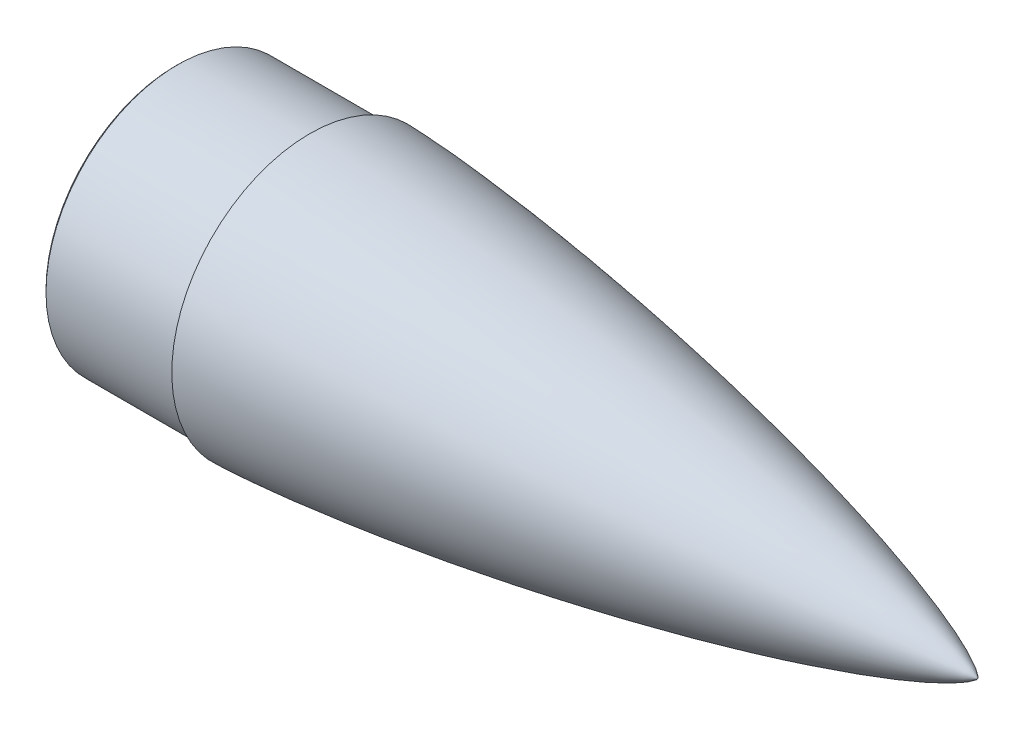
ISO-10303-21;
HEADER;
FILE_DESCRIPTION(('STEP AP214'),'2;1');
FILE_NAME('part.step','',(''),(''),'','','');
FILE_SCHEMA(('AUTOMOTIVE_DESIGN { 1 0 10303 214 1 1 1 1 }'));
ENDSEC;
DATA;
#1=APPLICATION_CONTEXT('core data for automotive mechanical design processes');
#2=APPLICATION_PROTOCOL_DEFINITION('international standard','automotive_design',2000,#1);
#3=PRODUCT_CONTEXT('',#1,'mechanical');
#4=PRODUCT('Part','Part','',(#3));
#5=PRODUCT_RELATED_PRODUCT_CATEGORY('part','',(#4));
#6=PRODUCT_DEFINITION_FORMATION('','',#4);
#7=PRODUCT_DEFINITION_CONTEXT('part definition',#1,'design');
#8=PRODUCT_DEFINITION('design','',#6,#7);
#9=PRODUCT_DEFINITION_SHAPE('','',#8);
#10=(LENGTH_UNIT() NAMED_UNIT(*) SI_UNIT(.MILLI.,.METRE.));
#11=(NAMED_UNIT(*) PLANE_ANGLE_UNIT() SI_UNIT($,.RADIAN.));
#12=(NAMED_UNIT(*) SI_UNIT($,.STERADIAN.) SOLID_ANGLE_UNIT());
#13=UNCERTAINTY_MEASURE_WITH_UNIT(LENGTH_MEASURE(1.E-05),#10,'distance_accuracy_value','');
#14=(GEOMETRIC_REPRESENTATION_CONTEXT(3) GLOBAL_UNCERTAINTY_ASSIGNED_CONTEXT((#13)) GLOBAL_UNIT_ASSIGNED_CONTEXT((#10,
#11,#12)) REPRESENTATION_CONTEXT('',''));
#15=CARTESIAN_POINT('',(0.,0.,0.));
#16=DIRECTION('',(0.,0.,1.));
#17=DIRECTION('',(1.,0.,0.));
#18=AXIS2_PLACEMENT_3D('',#15,#16,#17);
#19=CARTESIAN_POINT('',(-82.1546874731784,77.55,0.));
#20=DIRECTION('',(-1.,0.,0.));
#21=DIRECTION('',(0.,0.,1.));
#22=AXIS2_PLACEMENT_3D('',#19,#20,#21);
#23=PLANE('',#22);
#24=CARTESIAN_POINT('',(-82.1546874731784,0.,0.));
#25=DIRECTION('',(-1.,0.,0.));
#26=DIRECTION('',(0.,0.,1.));
#27=AXIS2_PLACEMENT_3D('',#24,#25,#26);
#28=CIRCLE('',#27,79.0500000000001);
#29=CARTESIAN_POINT('',(-82.1546874731784,0.,79.0500000000001));
#30=VERTEX_POINT('',#29);
#31=EDGE_CURVE('E11',#30,#30,#28,.T.);
#32=ORIENTED_EDGE('',*,*,#31,.T.);
#33=EDGE_LOOP('',(#32));
#34=FACE_BOUND('',#33,.T.);
#35=CARTESIAN_POINT('',(-82.1546874731784,0.,0.));
#36=DIRECTION('',(1.,0.,0.));
#37=DIRECTION('',(0.,0.,-1.));
#38=AXIS2_PLACEMENT_3D('',#35,#36,#37);
#39=CIRCLE('',#38,77.55);
#40=CARTESIAN_POINT('',(-82.1546874731784,0.,-77.55));
#41=VERTEX_POINT('',#40);
#42=EDGE_CURVE('E60',#41,#41,#39,.T.);
#43=ORIENTED_EDGE('',*,*,#42,.T.);
#44=EDGE_LOOP('',(#43));
#45=FACE_BOUND('',#44,.T.);
#46=ADVANCED_FACE('F35',(#34,#45),#23,.T.);
#47=CARTESIAN_POINT('',(446.938975823445,0.,0.));
#48=DIRECTION('',(1.,0.,0.));
#49=DIRECTION('',(0.,0.,-1.));
#50=AXIS2_PLACEMENT_3D('',#47,#48,#49);
#51=CYLINDRICAL_SURFACE('',#50,80.55);
#52=CARTESIAN_POINT('',(-80.6546874731784,0.,0.));
#53=DIRECTION('',(-1.,0.,0.));
#54=DIRECTION('',(0.,0.,1.));
#55=AXIS2_PLACEMENT_3D('',#52,#53,#54);
#56=CIRCLE('',#55,80.55);
#57=CARTESIAN_POINT('',(-80.6546874731784,0.,80.55));
#58=VERTEX_POINT('',#57);
#59=EDGE_CURVE('E43',#58,#58,#56,.F.);
#60=ORIENTED_EDGE('',*,*,#59,.T.);
#61=EDGE_LOOP('',(#60));
#62=FACE_BOUND('',#61,.T.);
#63=CARTESIAN_POINT('',(0.395312526821567,0.,0.));
#64=DIRECTION('',(1.,0.,0.));
#65=DIRECTION('',(0.,0.,-1.));
#66=AXIS2_PLACEMENT_3D('',#63,#64,#65);
#67=CIRCLE('',#66,80.55);
#68=CARTESIAN_POINT('',(0.395312526821567,0.,-80.55));
#69=VERTEX_POINT('',#68);
#70=EDGE_CURVE('E63',#69,#69,#67,.T.);
#71=ORIENTED_EDGE('',*,*,#70,.F.);
#72=EDGE_LOOP('',(#71));
#73=FACE_BOUND('',#72,.T.);
#74=ADVANCED_FACE('F73',(#62,#73),#51,.T.);
#75=CARTESIAN_POINT('',(0.395312526821541,80.55,0.));
#76=DIRECTION('',(-1.,0.,0.));
#77=DIRECTION('',(0.,0.,1.));
#78=AXIS2_PLACEMENT_3D('',#75,#76,#77);
#79=PLANE('',#78);
#80=ORIENTED_EDGE('',*,*,#70,.T.);
#81=EDGE_LOOP('',(#80));
#82=FACE_BOUND('',#81,.T.);
#83=CARTESIAN_POINT('',(0.395312526821512,0.,0.));
#84=DIRECTION('',(1.,0.,0.));
#85=DIRECTION('',(0.,0.,-1.));
#86=AXIS2_PLACEMENT_3D('',#83,#84,#85);
#87=CIRCLE('',#86,84.55);
#88=CARTESIAN_POINT('',(0.395312526821512,0.,-84.55));
#89=VERTEX_POINT('',#88);
#90=EDGE_CURVE('E59',#89,#89,#87,.T.);
#91=ORIENTED_EDGE('',*,*,#90,.F.);
#92=EDGE_LOOP('',(#91));
#93=FACE_BOUND('',#92,.T.);
#94=ADVANCED_FACE('F88',(#82,#93),#79,.T.);
#95=CARTESIAN_POINT('',(409.481241764189,0.,0.));
#96=CARTESIAN_POINT('',(409.478822601919,0.0134874848034877,0.));
#97=CARTESIAN_POINT('',(409.471791677342,0.0398601656273999,0.));
#98=CARTESIAN_POINT('',(409.449968720415,0.0902999227670085,0.));
#99=CARTESIAN_POINT('',(409.405170369338,0.173604409687341,0.));
#100=CARTESIAN_POINT('',(409.338622840785,0.274707125771257,0.));
#101=CARTESIAN_POINT('',(409.233198983525,0.414354859548854,0.));
#102=CARTESIAN_POINT('',(409.07147327629,0.602630626079753,0.));
#103=CARTESIAN_POINT('',(408.814393210848,0.868443813730267,0.));
#104=CARTESIAN_POINT('',(408.376034854526,1.26869965608439,0.));
#105=CARTESIAN_POINT('',(407.623681971435,1.87404478569731,0.));
#106=CARTESIAN_POINT('',(406.300886659188,2.8068947395549,0.));
#107=CARTESIAN_POINT('',(403.95080597349,4.25408937904938,0.));
#108=CARTESIAN_POINT('',(399.800317203866,6.47392409839895,0.));
#109=CARTESIAN_POINT('',(392.936954952309,9.6599404642413,0.));
#110=CARTESIAN_POINT('',(381.088920065306,14.4581339575108,0.));
#111=CARTESIAN_POINT('',(364.027881020813,20.4397191359033,0.));
#112=CARTESIAN_POINT('',(342.565783157529,27.0760244846852,0.));
#113=CARTESIAN_POINT('',(317.73737708489,33.9484831644934,0.));
#114=CARTESIAN_POINT('',(292.149117175932,40.4024655304525,0.));
#115=CARTESIAN_POINT('',(266.444005618304,46.3727098647867,0.));
#116=CARTESIAN_POINT('',(240.645313143409,51.9226607221545,0.));
#117=CARTESIAN_POINT('',(214.76726000471,57.0896877784174,0.));
#118=CARTESIAN_POINT('',(188.820024567127,61.8964352607828,0.));
#119=CARTESIAN_POINT('',(166.061529057996,65.7958285026385,0.));
#120=CARTESIAN_POINT('',(146.518269236537,68.919295389762,0.));
#121=CARTESIAN_POINT('',(130.209185955368,71.3727589677891,0.));
#122=CARTESIAN_POINT('',(117.148436808321,73.2437396599762,0.));
#123=CARTESIAN_POINT('',(104.074432980623,75.0198116144657,0.));
#124=CARTESIAN_POINT('',(92.6232343388655,76.487170689314,0.));
#125=CARTESIAN_POINT('',(82.799789073107,77.6794394149247,0.));
#126=CARTESIAN_POINT('',(74.6081648030385,78.6269860392199,0.));
#127=CARTESIAN_POINT('',(68.0515971529118,79.3562948036812,0.));
#128=CARTESIAN_POINT('',(61.4917520482685,80.0555707697364,0.));
#129=CARTESIAN_POINT('',(54.9286079289877,80.7232560717041,0.));
#130=CARTESIAN_POINT('',(48.3621514851083,81.3574828106379,0.));
#131=CARTESIAN_POINT('',(41.7923448713552,81.955972250993,0.));
#132=CARTESIAN_POINT('',(36.040789438939,82.445886317684,0.));
#133=CARTESIAN_POINT('',(31.1087229330659,82.8394168465321,0.));
#134=CARTESIAN_POINT('',(26.9971953518502,83.1482199739406,0.));
#135=CARTESIAN_POINT('',(23.7070777688377,83.3830577294638,0.));
#136=CARTESIAN_POINT('',(20.0916945324107,83.6266272413755,0.));
#137=CARTESIAN_POINT('',(16.7244393247732,83.8370240075456,0.));
#138=CARTESIAN_POINT('',(13.6055336099118,84.0162862354662,0.));
#139=CARTESIAN_POINT('',(10.7351864961894,84.1666980434028,0.));
#140=CARTESIAN_POINT('',(8.43841491035054,84.2770647268193,0.));
#141=CARTESIAN_POINT('',(6.14113862844764,84.3767549412682,0.));
#142=CARTESIAN_POINT('',(4.13054718030492,84.4518639875451,0.));
#143=CARTESIAN_POINT('',(2.40683330966491,84.5068417560256,0.));
#144=CARTESIAN_POINT('',(1.25745784263011,84.5343584109083,0.));
#145=CARTESIAN_POINT('',(0.682722204443668,84.5468067956223,0.));
#146=CARTESIAN_POINT('',(0.395312526821514,84.55,0.));
#147=B_SPLINE_CURVE_WITH_KNOTS('',4,(#95,#96,#97,#98,#99,#100,#101,#102,#103,#104,#105,#106,
#107,#108,#109,#110,#111,#112,#113,#114,#115,#116,#117,#118,#119,#120,#121,#122,#123,#124,#125,
#126,#127,#128,#129,#130,#131,#132,#133,#134,#135,#136,#137,#138,#139,#140,#141,#142,#143,#144,
#145,#146),.UNSPECIFIED.,.F.,.F.,(5,1,1,1,1,1,1,1,1,1,1,1,1,1,1,1,1,1,1,1,1,1,1,1,1,1,1,1,1,1,1,
1,1,1,1,1,1,1,1,1,1,1,1,1,1,1,1,1,5),(0.,0.000130122730793774,0.000260245461587547,
0.000520490923175095,0.000900390598891898,0.0012802902746087,0.00192509879202123,
0.00288150817718921,0.00441820752915464,0.00692708577491599,0.0111106973974526,
0.0182791377136376,0.0306727604209067,0.051704468996729,0.0831022801208259,0.139908797407073,
0.202702512646724,0.26549616528218,0.328289681584927,0.391083359416936,0.453876973450593,
0.516670577319054,0.579464196659418,0.642257765268514,0.673654596336679,0.705051427404843,
0.736448266643587,0.76784510588233,0.799241873583516,0.814940257434108,0.830638641284701,
0.846337072983396,0.862035504682092,0.877733936380787,0.893432368079482,0.909130719940439,
0.924829071801395,0.932678247731873,0.940527423662352,0.94837659959283,0.956225775523308,
0.967169331642481,0.972641109702068,0.978112887761654,0.983584665821241,0.989056443880827,
0.994528221940413,0.997264110970207,1.),.UNSPECIFIED.);
#148=CARTESIAN_POINT('',(446.938975823445,0.,0.));
#149=DIRECTION('',(1.,0.,0.));
#150=AXIS1_PLACEMENT('',#148,#149);
#151=SURFACE_OF_REVOLUTION('',#147,#150);
#152=ORIENTED_EDGE('',*,*,#90,.T.);
#153=EDGE_LOOP('',(#152));
#154=FACE_BOUND('',#153,.T.);
#155=CARTESIAN_POINT('',(409.481241764189,0.,0.));
#156=VERTEX_POINT('',#155);
#157=VERTEX_LOOP('',#156);
#158=FACE_BOUND('',#157,.T.);
#159=ADVANCED_FACE('F53',(#154,#158),#151,.F.);
#160=CARTESIAN_POINT('',(10.6358746490479,77.55,0.));
#161=CARTESIAN_POINT('',(10.8827417278131,77.5461877921836,0.));
#162=CARTESIAN_POINT('',(11.3763800665137,77.5332937377559,0.));
#163=CARTESIAN_POINT('',(12.3635618939081,77.5051785681621,0.));
#164=CARTESIAN_POINT('',(13.8439776983511,77.4511614005539,0.));
#165=CARTESIAN_POINT('',(15.5707272501838,77.3784624838972,0.));
#166=CARTESIAN_POINT('',(18.0368536792275,77.259743837378,0.));
#167=CARTESIAN_POINT('',(20.9952306337556,77.0983172735264,0.));
#168=CARTESIAN_POINT('',(24.183147105571,76.9026736794414,0.));
#169=CARTESIAN_POINT('',(27.6003765454956,76.6717606479992,0.));
#170=CARTESIAN_POINT('',(30.7544184220987,76.4426881135515,0.));
#171=CARTESIAN_POINT('',(33.6455901319164,76.2207593011673,0.));
#172=CARTESIAN_POINT('',(37.2584615345661,75.9294538890551,0.));
#173=CARTESIAN_POINT('',(41.5921876458737,75.5590597608729,0.));
#174=CARTESIAN_POINT('',(46.64575484689,75.0990049973894,0.));
#175=CARTESIAN_POINT('',(52.4179745587187,74.5382936214568,0.));
#176=CARTESIAN_POINT('',(58.1869658177688,73.9452467582986,0.));
#177=CARTESIAN_POINT('',(63.9527729399978,73.3219531447722,0.));
#178=CARTESIAN_POINT('',(69.7154129856911,72.670115402662,0.));
#179=CARTESIAN_POINT('',(75.4749122602043,71.9911565846709,0.));
#180=CARTESIAN_POINT('',(82.6703773654153,71.110042235571,0.));
#181=CARTESIAN_POINT('',(91.2987128048111,70.0028864438135,0.));
#182=CARTESIAN_POINT('',(101.356055228832,68.6423236437011,0.));
#183=CARTESIAN_POINT('',(112.837717734699,66.9980827794549,0.));
#184=CARTESIAN_POINT('',(124.30679318228,65.2683446318266,0.));
#185=CARTESIAN_POINT('',(138.627190744564,63.0028532919869,0.));
#186=CARTESIAN_POINT('',(155.785532920367,60.1228755585035,0.));
#187=CARTESIAN_POINT('',(175.763975961861,56.5332128551654,0.));
#188=CARTESIAN_POINT('',(198.537651833495,52.1158999558315,0.));
#189=CARTESIAN_POINT('',(221.246296692554,47.3750263475244,0.));
#190=CARTESIAN_POINT('',(243.880560946437,42.290562891685,0.));
#191=CARTESIAN_POINT('',(266.427265346447,36.8293361964745,0.));
#192=CARTESIAN_POINT('',(288.864918388321,30.9350597621527,0.));
#193=CARTESIAN_POINT('',(310.628295275035,24.6696898992195,0.));
#194=CARTESIAN_POINT('',(329.431545128373,18.6326204828168,0.));
#195=CARTESIAN_POINT('',(344.391180353833,13.1971673493419,0.));
#196=CARTESIAN_POINT('',(354.805328477106,8.83675946825788,0.));
#197=CARTESIAN_POINT('',(360.865618952558,5.93421108570621,0.));
#198=CARTESIAN_POINT('',(364.55801761825,3.89920090806456,0.));
#199=CARTESIAN_POINT('',(366.657962176809,2.56670016782429,0.));
#200=CARTESIAN_POINT('',(367.837373574742,1.70957345501094,0.));
#201=CARTESIAN_POINT('',(368.508258256066,1.15291224230159,0.));
#202=CARTESIAN_POINT('',(368.897069052905,0.786384210979209,0.));
#203=CARTESIAN_POINT('',(369.12386129618,0.543957157047634,0.));
#204=CARTESIAN_POINT('',(369.265020656144,0.37389973899023,0.));
#205=CARTESIAN_POINT('',(369.356429792878,0.248740064714929,0.));
#206=CARTESIAN_POINT('',(369.414328458611,0.157917728738281,0.));
#207=CARTESIAN_POINT('',(369.453597969974,0.0826271218199635,0.));
#208=CARTESIAN_POINT('',(369.472953976563,0.0364182755173289,0.));
#209=CARTESIAN_POINT('',(369.479136426724,0.0123132965959352,0.));
#210=CARTESIAN_POINT('',(369.481241764189,0.,0.));
#211=B_SPLINE_CURVE_WITH_KNOTS('',4,(#160,#161,#162,#163,#164,#165,#166,#167,#168,#169,#170,
#171,#172,#173,#174,#175,#176,#177,#178,#179,#180,#181,#182,#183,#184,#185,#186,#187,#188,#189,
#190,#191,#192,#193,#194,#195,#196,#197,#198,#199,#200,#201,#202,#203,#204,#205,#206,#207,#208,
#209,#210),.UNSPECIFIED.,.F.,.F.,(5,1,1,1,1,1,1,1,1,1,1,1,1,1,1,1,1,1,1,1,1,1,1,1,1,1,1,1,1,1,1,
1,1,1,1,1,1,1,1,1,1,1,1,1,1,1,1,5),(0.,0.00267332156609734,0.00534664313219468,
0.0106932862643895,0.0160399293965843,0.021386572528779,0.0320798587931685,0.042773145057558,
0.0506223349078954,0.0584715247582326,0.0663207146085698,0.074169904458907,0.0898682841595815,
0.105566663860256,0.121265134584789,0.136963605309322,0.152662076033855,0.168360546758388,
0.184058942935828,0.199757339113268,0.231154131468147,0.262550886490344,0.29394764151254,
0.325344406758662,0.356741172004785,0.419534808562641,0.482328436101487,0.545122036291668,
0.607915624936877,0.670709183693257,0.733502936348634,0.796296508229939,0.85908986423855,
0.915896991665115,0.94729452063823,0.968576133134425,0.9812921334051,0.988619736529035,
0.99291868778682,0.995488130531398,0.997068640426043,0.998052569267782,0.998700722693834,
0.99908046259367,0.999460202493506,0.999730101246753,0.999865050623376,1.),.UNSPECIFIED.);
#212=CARTESIAN_POINT('',(446.938975823445,0.,0.));
#213=DIRECTION('',(1.,0.,0.));
#214=AXIS1_PLACEMENT('',#212,#213);
#215=SURFACE_OF_REVOLUTION('',#211,#214);
#216=CARTESIAN_POINT('',(369.481241764189,0.,0.));
#217=VERTEX_POINT('',#216);
#218=VERTEX_LOOP('',#217);
#219=FACE_BOUND('',#218,.T.);
#220=CARTESIAN_POINT('',(10.6358746490479,0.,0.));
#221=DIRECTION('',(1.,0.,0.));
#222=DIRECTION('',(0.,0.,-1.));
#223=AXIS2_PLACEMENT_3D('',#220,#221,#222);
#224=CIRCLE('',#223,77.55);
#225=CARTESIAN_POINT('',(10.6358746490479,0.,-77.55));
#226=VERTEX_POINT('',#225);
#227=EDGE_CURVE('E57',#226,#226,#224,.T.);
#228=ORIENTED_EDGE('',*,*,#227,.F.);
#229=EDGE_LOOP('',(#228));
#230=FACE_BOUND('',#229,.T.);
#231=ADVANCED_FACE('F49',(#219,#230),#215,.F.);
#232=CARTESIAN_POINT('',(446.938975823445,0.,0.));
#233=DIRECTION('',(1.,0.,0.));
#234=DIRECTION('',(0.,0.,-1.));
#235=AXIS2_PLACEMENT_3D('',#232,#233,#234);
#236=CYLINDRICAL_SURFACE('',#235,77.55);
#237=ORIENTED_EDGE('',*,*,#227,.T.);
#238=EDGE_LOOP('',(#237));
#239=FACE_BOUND('',#238,.T.);
#240=ORIENTED_EDGE('',*,*,#42,.F.);
#241=EDGE_LOOP('',(#240));
#242=FACE_BOUND('',#241,.T.);
#243=ADVANCED_FACE('F52',(#239,#242),#236,.F.);
#244=CARTESIAN_POINT('',(-80.6546874731784,0.,0.));
#245=DIRECTION('',(1.,0.,0.));
#246=DIRECTION('',(0.,0.,-1.));
#247=AXIS2_PLACEMENT_3D('',#244,#245,#246);
#248=CONICAL_SURFACE('',#247,80.55,0.785398163397407);
#249=ORIENTED_EDGE('',*,*,#31,.F.);
#250=EDGE_LOOP('',(#249));
#251=FACE_BOUND('',#250,.T.);
#252=ORIENTED_EDGE('',*,*,#59,.F.);
#253=EDGE_LOOP('',(#252));
#254=FACE_BOUND('',#253,.T.);
#255=ADVANCED_FACE('F37',(#251,#254),#248,.T.);
#256=CLOSED_SHELL('',(#46,#74,#94,#159,#231,#243,#255));
#257=MANIFOLD_SOLID_BREP('B2',#256);
#258=ADVANCED_BREP_SHAPE_REPRESENTATION('',(#18,#257),#14);
#259=SHAPE_DEFINITION_REPRESENTATION(#9,#258);
ENDSEC;
END-ISO-10303-21;
